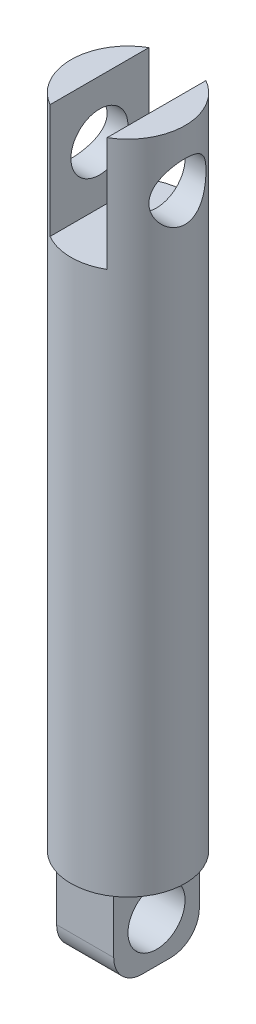
ISO-10303-21;
HEADER;
FILE_DESCRIPTION(('STEP AP214'),'2;1');
FILE_NAME('part.step','',(''),(''),'','','');
FILE_SCHEMA(('AUTOMOTIVE_DESIGN { 1 0 10303 214 1 1 1 1 }'));
ENDSEC;
DATA;
#1=APPLICATION_CONTEXT('core data for automotive mechanical design processes');
#2=APPLICATION_PROTOCOL_DEFINITION('international standard','automotive_design',2000,#1);
#3=PRODUCT_CONTEXT('',#1,'mechanical');
#4=PRODUCT('Part','Part','',(#3));
#5=PRODUCT_RELATED_PRODUCT_CATEGORY('part','',(#4));
#6=PRODUCT_DEFINITION_FORMATION('','',#4);
#7=PRODUCT_DEFINITION_CONTEXT('part definition',#1,'design');
#8=PRODUCT_DEFINITION('design','',#6,#7);
#9=PRODUCT_DEFINITION_SHAPE('','',#8);
#10=(LENGTH_UNIT() NAMED_UNIT(*) SI_UNIT(.MILLI.,.METRE.));
#11=(NAMED_UNIT(*) PLANE_ANGLE_UNIT() SI_UNIT($,.RADIAN.));
#12=(NAMED_UNIT(*) SI_UNIT($,.STERADIAN.) SOLID_ANGLE_UNIT());
#13=UNCERTAINTY_MEASURE_WITH_UNIT(LENGTH_MEASURE(1.E-05),#10,'distance_accuracy_value','');
#14=(GEOMETRIC_REPRESENTATION_CONTEXT(3) GLOBAL_UNCERTAINTY_ASSIGNED_CONTEXT((#13)) GLOBAL_UNIT_ASSIGNED_CONTEXT((#10,
#11,#12)) REPRESENTATION_CONTEXT('',''));
#15=CARTESIAN_POINT('',(0.,0.,0.));
#16=DIRECTION('',(0.,0.,1.));
#17=DIRECTION('',(1.,0.,0.));
#18=AXIS2_PLACEMENT_3D('',#15,#16,#17);
#19=CARTESIAN_POINT('',(0.,115.,0.));
#20=DIRECTION('',(0.,1.,0.));
#21=DIRECTION('',(0.,0.,1.));
#22=AXIS2_PLACEMENT_3D('',#19,#20,#21);
#23=PLANE('',#22);
#24=DIRECTION('',(0.,0.,-1.));
#25=VECTOR('',#24,1.);
#26=CARTESIAN_POINT('',(5.,115.,0.));
#27=LINE('',#26,#25);
#28=CARTESIAN_POINT('',(5.,115.,8.66025403784438));
#29=VERTEX_POINT('',#28);
#30=CARTESIAN_POINT('',(5.,115.,-8.66025403784439));
#31=VERTEX_POINT('',#30);
#32=EDGE_CURVE('E124',#29,#31,#27,.T.);
#33=ORIENTED_EDGE('',*,*,#32,.F.);
#34=CARTESIAN_POINT('',(0.,115.,0.));
#35=DIRECTION('',(0.,1.,0.));
#36=DIRECTION('',(0.,0.,1.));
#37=AXIS2_PLACEMENT_3D('',#34,#35,#36);
#38=CIRCLE('',#37,10.);
#39=EDGE_CURVE('E139',#29,#31,#38,.T.);
#40=ORIENTED_EDGE('',*,*,#39,.T.);
#41=EDGE_LOOP('',(#33,#40));
#42=FACE_BOUND('',#41,.T.);
#43=ADVANCED_FACE('F39',(#42),#23,.T.);
#44=CARTESIAN_POINT('',(0.,0.,0.));
#45=DIRECTION('',(0.,1.,0.));
#46=DIRECTION('',(0.,0.,1.));
#47=AXIS2_PLACEMENT_3D('',#44,#45,#46);
#48=PLANE('',#47);
#49=CARTESIAN_POINT('',(0.,0.,0.));
#50=DIRECTION('',(0.,1.,0.));
#51=DIRECTION('',(0.,0.,1.));
#52=AXIS2_PLACEMENT_3D('',#49,#50,#51);
#53=CIRCLE('',#52,10.);
#54=CARTESIAN_POINT('',(0.,0.,10.));
#55=VERTEX_POINT('',#54);
#56=EDGE_CURVE('E190',#55,#55,#53,.T.);
#57=ORIENTED_EDGE('',*,*,#56,.F.);
#58=EDGE_LOOP('',(#57));
#59=FACE_BOUND('',#58,.T.);
#60=DIRECTION('',(0.,0.,-1.));
#61=VECTOR('',#60,1.);
#62=CARTESIAN_POINT('',(-5.,0.,7.5));
#63=LINE('',#62,#61);
#64=CARTESIAN_POINT('',(-5.,0.,7.5));
#65=VERTEX_POINT('',#64);
#66=CARTESIAN_POINT('',(-5.,0.,-7.5));
#67=VERTEX_POINT('',#66);
#68=EDGE_CURVE('E164',#65,#67,#63,.T.);
#69=ORIENTED_EDGE('',*,*,#68,.F.);
#70=DIRECTION('',(-1.,0.,0.));
#71=VECTOR('',#70,1.);
#72=CARTESIAN_POINT('',(5.,0.,7.5));
#73=LINE('',#72,#71);
#74=CARTESIAN_POINT('',(5.,0.,7.5));
#75=VERTEX_POINT('',#74);
#76=EDGE_CURVE('E159',#75,#65,#73,.T.);
#77=ORIENTED_EDGE('',*,*,#76,.F.);
#78=DIRECTION('',(0.,0.,1.));
#79=VECTOR('',#78,1.);
#80=CARTESIAN_POINT('',(5.,0.,7.5));
#81=LINE('',#80,#79);
#82=CARTESIAN_POINT('',(5.,0.,-7.5));
#83=VERTEX_POINT('',#82);
#84=EDGE_CURVE('E172',#83,#75,#81,.T.);
#85=ORIENTED_EDGE('',*,*,#84,.F.);
#86=DIRECTION('',(1.,0.,0.));
#87=VECTOR('',#86,1.);
#88=CARTESIAN_POINT('',(5.,0.,-7.5));
#89=LINE('',#88,#87);
#90=EDGE_CURVE('E168',#67,#83,#89,.T.);
#91=ORIENTED_EDGE('',*,*,#90,.F.);
#92=EDGE_LOOP('',(#69,#77,#85,#91));
#93=FACE_BOUND('',#92,.T.);
#94=ADVANCED_FACE('F238',(#59,#93),#48,.F.);
#95=CARTESIAN_POINT('',(0.,95.,0.));
#96=DIRECTION('',(0.,-1.,0.));
#97=DIRECTION('',(0.,0.,-1.));
#98=AXIS2_PLACEMENT_3D('',#95,#96,#97);
#99=CYLINDRICAL_SURFACE('',#98,10.);
#100=CARTESIAN_POINT('',(-10.,100.,0.));
#101=CARTESIAN_POINT('',(-9.99999960171885,100.000000432216,-0.131488890078729));
#102=CARTESIAN_POINT('',(-9.99740053121284,100.005192775285,-0.262986970217153));
#103=CARTESIAN_POINT('',(-9.98706977835168,100.025902894112,-0.525014586348057));
#104=CARTESIAN_POINT('',(-9.97933586314931,100.041425161764,-0.655543676003295));
#105=CARTESIAN_POINT('',(-9.95892066969002,100.082640779477,-0.914783203431134));
#106=CARTESIAN_POINT('',(-9.94623233642882,100.108348634406,-1.04349077535257));
#107=CARTESIAN_POINT('',(-9.91622716576671,100.169650672563,-1.29802636754293));
#108=CARTESIAN_POINT('',(-9.89890843630383,100.205248897406,-1.42385318781692));
#109=CARTESIAN_POINT('',(-9.86015430154804,100.285778482451,-1.67121386584967));
#110=CARTESIAN_POINT('',(-9.83873709670758,100.330668648548,-1.79276399094561));
#111=CARTESIAN_POINT('',(-9.79224427489324,100.429448797807,-2.0314444775119));
#112=CARTESIAN_POINT('',(-9.7671672814684,100.483342168193,-2.14857315511665));
#113=CARTESIAN_POINT('',(-9.68730860488736,100.657799628939,-2.49222561412914));
#114=CARTESIAN_POINT('',(-9.6278546021617,100.79123077324,-2.71128846115304));
#115=CARTESIAN_POINT('',(-9.49780663424161,101.097605281245,-3.13758045755124));
#116=CARTESIAN_POINT('',(-9.42675632671347,101.27245069028,-3.34329192972867));
#117=CARTESIAN_POINT('',(-9.28300214475253,101.652589088283,-3.72388133818108));
#118=CARTESIAN_POINT('',(-9.21029705743542,101.857905061984,-3.89873577832563));
#119=CARTESIAN_POINT('',(-9.06493867332992,102.312475147464,-4.22628385620055));
#120=CARTESIAN_POINT('',(-8.99272664170301,102.563901891317,-4.37620734766694));
#121=CARTESIAN_POINT('',(-8.89637417546676,102.959918044368,-4.56723365243868));
#122=CARTESIAN_POINT('',(-8.86624279684719,103.09511829056,-4.62527981130998));
#123=CARTESIAN_POINT('',(-8.81109611627222,103.371001251774,-4.72948843578257));
#124=CARTESIAN_POINT('',(-8.78607778701962,103.511680663639,-4.77565793744269));
#125=CARTESIAN_POINT('',(-8.74350562362058,103.788992754156,-4.8531380584616));
#126=CARTESIAN_POINT('',(-8.72559704108876,103.925370479978,-4.88516762296959));
#127=CARTESIAN_POINT('',(-8.69596333711106,104.20092569748,-4.93772573892406));
#128=CARTESIAN_POINT('',(-8.68423493515241,104.340101663006,-4.95826039236648));
#129=CARTESIAN_POINT('',(-8.66746161087014,104.620007461111,-4.98752398958936));
#130=CARTESIAN_POINT('',(-8.66241266349287,104.760736306314,-4.99626004329765));
#131=CARTESIAN_POINT('',(-8.65921299638944,105.04250117629,-5.00180399494055));
#132=CARTESIAN_POINT('',(-8.66106161851229,105.183537170471,-4.99861303092504));
#133=CARTESIAN_POINT('',(-8.67093727173593,105.447703572877,-4.98145803092846));
#134=CARTESIAN_POINT('',(-8.6781966350113,105.57095260281,-4.96883208371091));
#135=CARTESIAN_POINT('',(-8.69773906996623,105.815821213967,-4.93454402662215));
#136=CARTESIAN_POINT('',(-8.71002371946268,105.937440271022,-4.91287907868334));
#137=CARTESIAN_POINT('',(-8.73921479576949,106.178197874313,-4.86076278292653));
#138=CARTESIAN_POINT('',(-8.75612065195561,106.29733672485,-4.83031251988904));
#139=CARTESIAN_POINT('',(-8.79403073984606,106.532471376954,-4.76094319159973));
#140=CARTESIAN_POINT('',(-8.81503658165343,106.648465923276,-4.72202079856857));
#141=CARTESIAN_POINT('',(-8.88436032421636,106.996006871619,-4.59108661358502));
#142=CARTESIAN_POINT('',(-8.93828791833521,107.221693356038,-4.48608785825887));
#143=CARTESIAN_POINT('',(-9.05517433078603,107.653210118223,-4.24519591002764));
#144=CARTESIAN_POINT('',(-9.11813720101033,107.859031417759,-4.10928884013355));
#145=CARTESIAN_POINT('',(-9.25565455759079,108.272588528204,-3.79034422310329));
#146=CARTESIAN_POINT('',(-9.3306665420313,108.477258007707,-3.60351571642877));
#147=CARTESIAN_POINT('',(-9.47739013910051,108.853703465689,-3.19773444843253));
#148=CARTESIAN_POINT('',(-9.54910016205801,109.025463723821,-2.97876642220598));
#149=CARTESIAN_POINT('',(-9.65034506582221,109.258440897113,-2.62430600098782));
#150=CARTESIAN_POINT('',(-9.68370380274255,109.333352095146,-2.4987100233616));
#151=CARTESIAN_POINT('',(-9.74663052718473,109.472208202972,-2.24071060142561));
#152=CARTESIAN_POINT('',(-9.77620011135783,109.536157735591,-2.1083100575541));
#153=CARTESIAN_POINT('',(-9.83067553510545,109.652398875383,-1.83762803314804));
#154=CARTESIAN_POINT('',(-9.85558325144946,109.704695175525,-1.6993489468218));
#155=CARTESIAN_POINT('',(-9.89999026457503,109.79702492908,-1.41791187896085));
#156=CARTESIAN_POINT('',(-9.91949018350378,109.837059793182,-1.27475446078988));
#157=CARTESIAN_POINT('',(-9.95109597328192,109.901533563503,-0.996798015430418));
#158=CARTESIAN_POINT('',(-9.96368046334326,109.926989515402,-0.862288674029802));
#159=CARTESIAN_POINT('',(-9.98343035732268,109.966808041224,-0.59124836001247));
#160=CARTESIAN_POINT('',(-9.99059624028198,109.98117159579,-0.454717567193955));
#161=CARTESIAN_POINT('',(-9.99930380487356,109.998613162034,-0.18081070935965));
#162=CARTESIAN_POINT('',(-10.000847639673,110.001695494267,-0.0434349881359027));
#163=CARTESIAN_POINT('',(-9.99827237859039,109.996544426081,0.231047608581548));
#164=CARTESIAN_POINT('',(-9.99415353332644,109.988311526451,0.368154495704337));
#165=CARTESIAN_POINT('',(-9.98090973082445,109.961721326159,0.630324023952242));
#166=CARTESIAN_POINT('',(-9.97219922243105,109.944201622407,0.755493751243215));
#167=CARTESIAN_POINT('',(-9.95027227352716,109.899825526429,1.00380426086804));
#168=CARTESIAN_POINT('',(-9.93705440583578,109.872966176907,1.12694438760007));
#169=CARTESIAN_POINT('',(-9.90642450404115,109.810197316637,1.37032307172125));
#170=CARTESIAN_POINT('',(-9.88901375346268,109.774290575322,1.49056250470175));
#171=CARTESIAN_POINT('',(-9.85039368148873,109.693771838677,1.72747946867538));
#172=CARTESIAN_POINT('',(-9.82918290524069,109.649156508647,1.84415561535681));
#173=CARTESIAN_POINT('',(-9.75922876416581,109.50005219315,2.19430354472275));
#174=CARTESIAN_POINT('',(-9.70504904478179,109.382059258215,2.42111320848944));
#175=CARTESIAN_POINT('',(-9.58719375745591,109.11444780678,2.8523456015808));
#176=CARTESIAN_POINT('',(-9.5235141477638,108.964815818008,3.05675873773467));
#177=CARTESIAN_POINT('',(-9.38541505392104,108.621212708963,3.45882132675025));
#178=CARTESIAN_POINT('',(-9.31055499361995,108.424330408248,3.65383533419945));
#179=CARTESIAN_POINT('',(-9.16310881759143,108.000329462866,4.00930667677967));
#180=CARTESIAN_POINT('',(-9.09052430437331,107.773190076002,4.16974010650665));
#181=CARTESIAN_POINT('',(-8.98785260582618,107.407509433771,4.38466016919211));
#182=CARTESIAN_POINT('',(-8.95395955241383,107.278149125457,4.4532676226712));
#183=CARTESIAN_POINT('',(-8.89022352415079,107.013105899221,4.57918112262684));
#184=CARTESIAN_POINT('',(-8.86037871680369,106.877425879624,4.63649228788887));
#185=CARTESIAN_POINT('',(-8.80590327365628,106.600722964675,4.73913999074899));
#186=CARTESIAN_POINT('',(-8.78126837994728,106.45970454425,4.78448631442401));
#187=CARTESIAN_POINT('',(-8.73822819098157,106.173308957175,4.86265004333096));
#188=CARTESIAN_POINT('',(-8.7198219312185,106.027932469172,4.89546938847112));
#189=CARTESIAN_POINT('',(-8.69151275671386,105.748235018465,4.94553834792943));
#190=CARTESIAN_POINT('',(-8.6809632703526,105.61419211688,4.96397997433445));
#191=CARTESIAN_POINT('',(-8.66606824539577,105.344714754303,4.98993873206133));
#192=CARTESIAN_POINT('',(-8.66172205679783,105.209280440605,4.99745700797003));
#193=CARTESIAN_POINT('',(-8.65941425656731,104.938243074995,5.00145477351749));
#194=CARTESIAN_POINT('',(-8.66145040076353,104.80264009915,4.99793814327599));
#195=CARTESIAN_POINT('',(-8.67181681785816,104.532414442052,4.97992974203947));
#196=CARTESIAN_POINT('',(-8.68014683308828,104.397791720895,4.96543842034337));
#197=CARTESIAN_POINT('',(-8.70167828744801,104.143439797841,4.92759757627216));
#198=CARTESIAN_POINT('',(-8.71433770908853,104.023517440376,4.90522766015001));
#199=CARTESIAN_POINT('',(-8.74411599480516,103.786138809433,4.85194376743194));
#200=CARTESIAN_POINT('',(-8.76123623781642,103.668683310666,4.82102714868723));
#201=CARTESIAN_POINT('',(-8.81854231868724,103.321082884887,4.7159030607396));
#202=CARTESIAN_POINT('',(-8.86468813771129,103.095543905014,4.62929708984156));
#203=CARTESIAN_POINT('',(-8.97142890954605,102.646839657687,4.41907164675021));
#204=CARTESIAN_POINT('',(-9.03278633647388,102.424851924011,4.29335633682032));
#205=CARTESIAN_POINT('',(-9.16176636495219,102.003635890404,4.01075421010746));
#206=CARTESIAN_POINT('',(-9.22939221620456,101.804419516556,3.85385117607733));
#207=CARTESIAN_POINT('',(-9.37311444600789,101.409292141529,3.49102748964407));
#208=CARTESIAN_POINT('',(-9.44924162905911,101.216723981232,3.281467363426));
#209=CARTESIAN_POINT('',(-9.59389514971534,100.868665578817,2.83072875767416));
#210=CARTESIAN_POINT('',(-9.66241737976036,100.713195322256,2.58953334336127));
#211=CARTESIAN_POINT('',(-9.7541901337583,100.511369585473,2.20753881885375));
#212=CARTESIAN_POINT('',(-9.78304209980293,100.449132920594,2.07625512570271));
#213=CARTESIAN_POINT('',(-9.83614745234555,100.33606384388,1.80799529933999));
#214=CARTESIAN_POINT('',(-9.8604030970797,100.285225829469,1.67102200205152));
#215=CARTESIAN_POINT('',(-9.90354484128718,100.195654561633,1.39269501068689));
#216=CARTESIAN_POINT('',(-9.92244264379385,100.156894907012,1.25135162347082));
#217=CARTESIAN_POINT('',(-9.95434618112011,100.091862403731,0.965237205795564));
#218=CARTESIAN_POINT('',(-9.96735551489675,100.065581927473,0.82046832604838));
#219=CARTESIAN_POINT('',(-9.98476387878718,100.030525468001,0.563041654408166));
#220=CARTESIAN_POINT('',(-9.99046741601666,100.019088246308,0.450825809730031));
#221=CARTESIAN_POINT('',(-9.99808569986015,100.00382522175,0.22574224605027));
#222=CARTESIAN_POINT('',(-10.000000341898,99.9999996289711,0.11287450914219));
#223=CARTESIAN_POINT('',(-10.,100.,0.));
#224=B_SPLINE_CURVE_WITH_KNOTS('',3,(#100,#101,#102,#103,#104,#105,#106,#107,#108,#109,#110,
#111,#112,#113,#114,#115,#116,#117,#118,#119,#120,#121,#122,#123,#124,#125,#126,#127,#128,#129,
#130,#131,#132,#133,#134,#135,#136,#137,#138,#139,#140,#141,#142,#143,#144,#145,#146,#147,#148,
#149,#150,#151,#152,#153,#154,#155,#156,#157,#158,#159,#160,#161,#162,#163,#164,#165,#166,#167,
#168,#169,#170,#171,#172,#173,#174,#175,#176,#177,#178,#179,#180,#181,#182,#183,#184,#185,#186,
#187,#188,#189,#190,#191,#192,#193,#194,#195,#196,#197,#198,#199,#200,#201,#202,#203,#204,#205,
#206,#207,#208,#209,#210,#211,#212,#213,#214,#215,#216,#217,#218,#219,#220,#221,#222,#223),
.UNSPECIFIED.,.T.,.F.,(4,2,2,2,2,2,2,2,2,2,2,2,2,2,2,2,2,2,2,2,2,2,2,2,2,2,2,2,2,2,2,2,2,2,2,2,
2,2,2,2,2,2,2,2,2,2,2,2,2,2,2,2,2,2,2,2,2,2,2,2,2,4),(0.,0.394355294649891,0.788882184037819,
1.18397293369035,1.57922537181693,1.97276168530542,2.36644639154632,3.15295441699267,
3.98704440767527,4.821766802355,5.72122193562247,6.1712535998946,6.62101803579305,
7.04410338623952,7.46696393118357,7.88956954321094,8.31213483216671,8.68401534897463,
9.05601271689173,9.42796417149689,9.80006198990963,10.5608338020501,11.3219478566368,
12.1795688603196,13.03759852356,13.4870830845772,13.9363776171859,14.3854908824168,
14.8345524573652,15.2464230691107,15.6582572644723,16.0699337163998,16.4815919489941,
16.8612200640511,17.240968493866,17.6206008225791,18.0003788066131,18.7808755264615,
19.5617052624835,20.4192132572739,21.2773121558255,21.7277011924366,22.1778856687596,
22.6277007885002,23.0774462222894,23.4840267197959,23.8905646113036,24.2969595710184,
24.703337894006,25.0708552370355,25.4384863225851,26.1732662495599,26.9574126491567,
27.7419678673239,28.6218519479817,29.5022089791542,29.9460734671028,30.3897193096444,
30.8323885049027,31.2747867798493,31.6133053554877,31.9518332743452),.UNSPECIFIED.);
#225=CARTESIAN_POINT('',(-10.,100.,0.));
#226=VERTEX_POINT('',#225);
#227=EDGE_CURVE('E233',#226,#226,#224,.T.);
#228=ORIENTED_EDGE('',*,*,#227,.T.);
#229=EDGE_LOOP('',(#228));
#230=FACE_BOUND('',#229,.T.);
#231=CARTESIAN_POINT('',(8.66025403784438,105.,-5.00000000000001));
#232=CARTESIAN_POINT('',(8.66025482828518,104.869668343204,-4.99999937774204));
#233=CARTESIAN_POINT('',(8.66320639320551,104.739325091653,-4.99489703999515));
#234=CARTESIAN_POINT('',(8.67490215579888,104.479644781747,-4.97455590140419));
#235=CARTESIAN_POINT('',(8.68364905023327,104.3503082202,-4.95931238151412));
#236=CARTESIAN_POINT('',(8.7066291238278,104.093486462436,-4.91885673177677));
#237=CARTESIAN_POINT('',(8.72087090589727,103.966004496215,-4.89362896878987));
#238=CARTESIAN_POINT('',(8.75432466229381,103.713982535512,-4.83352579766963));
#239=CARTESIAN_POINT('',(8.77353879767271,103.589443845965,-4.79864619425837));
#240=CARTESIAN_POINT('',(8.83745677232208,103.222888792466,-4.6805346614708));
#241=CARTESIAN_POINT('',(8.88859880977519,102.986267679266,-4.58356144574886));
#242=CARTESIAN_POINT('',(9.00213659941723,102.532838045211,-4.35632594214356));
#243=CARTESIAN_POINT('',(9.06453296036385,102.316030597053,-4.22606185336435));
#244=CARTESIAN_POINT('',(9.19984032823,101.888489382253,-3.92334549410417));
#245=CARTESIAN_POINT('',(9.27319410334729,101.679731417677,-3.74829976483492));
#246=CARTESIAN_POINT('',(9.41860822234892,101.292930948451,-3.36622943427774));
#247=CARTESIAN_POINT('',(9.49066790509843,101.114903765034,-3.15918897852743));
#248=CARTESIAN_POINT('',(9.59484443095073,100.868773571314,-2.82033206345806));
#249=CARTESIAN_POINT('',(9.62993554487431,100.788086847899,-2.69838192133584));
#250=CARTESIAN_POINT('',(9.69680156689125,100.637371334578,-2.44722131237051));
#251=CARTESIAN_POINT('',(9.72857779329811,100.567338302637,-2.31801376345374));
#252=CARTESIAN_POINT('',(9.78789520431625,100.438623768707,-2.05317391777882));
#253=CARTESIAN_POINT('',(9.81543747951443,100.37993934252,-1.91754328730047));
#254=CARTESIAN_POINT('',(9.86547242365067,100.274568984172,-1.64079696990286));
#255=CARTESIAN_POINT('',(9.88796562891049,100.227881777567,-1.49968186742444));
#256=CARTESIAN_POINT('',(9.92580359946711,100.149984487482,-1.22330436599559));
#257=CARTESIAN_POINT('',(9.94154295735176,100.117909890396,-1.08833937324155));
#258=CARTESIAN_POINT('',(9.96761571585522,100.065033571396,-0.815709188800207));
#259=CARTESIAN_POINT('',(9.97794964280152,100.04423075194,-0.678044261360653));
#260=CARTESIAN_POINT('',(9.99290900237256,100.014180088583,-0.401217055741354));
#261=CARTESIAN_POINT('',(9.99753719051025,100.004926667024,-0.262055533104006));
#262=CARTESIAN_POINT('',(10.0009568128334,99.9980856666018,0.0166220416280755));
#263=CARTESIAN_POINT('',(9.99974860411976,100.000497374006,0.156138071510189));
#264=CARTESIAN_POINT('',(9.99189263105534,100.016230602951,0.422158287145522));
#265=CARTESIAN_POINT('',(9.9857287219252,100.028581770782,0.548735568605442));
#266=CARTESIAN_POINT('',(9.9687211507105,100.062832572355,0.800312348574876));
#267=CARTESIAN_POINT('',(9.95787601100424,100.084735221026,0.925311336065695));
#268=CARTESIAN_POINT('',(9.93176736436012,100.137846224237,1.17280363036129));
#269=CARTESIAN_POINT('',(9.91650533549045,100.169051465862,1.29529776073404));
#270=CARTESIAN_POINT('',(9.88192155120269,100.240447651518,1.53706747687735));
#271=CARTESIAN_POINT('',(9.86259824100145,100.280642037248,1.65634181022021));
#272=CARTESIAN_POINT('',(9.79859222392452,100.415374539564,2.01140340124729));
#273=CARTESIAN_POINT('',(9.74822622058319,100.523368958893,2.24122720645224));
#274=CARTESIAN_POINT('',(9.63687815372568,100.771329692493,2.67992393299637));
#275=CARTESIAN_POINT('',(9.57589229137331,100.911307453156,2.88878931500039));
#276=CARTESIAN_POINT('',(9.44222356886893,101.234463473773,3.30085071454948));
#277=CARTESIAN_POINT('',(9.36897995679247,101.420474603121,3.50164452019891));
#278=CARTESIAN_POINT('',(9.22270586177088,101.822989193921,3.87054772569917));
#279=CARTESIAN_POINT('',(9.14967558498933,102.039515896908,4.03863197852249));
#280=CARTESIAN_POINT('',(9.04390911775424,102.391193537281,4.26795395788391));
#281=CARTESIAN_POINT('',(9.00829977481543,102.51705093115,4.34240098162072));
#282=CARTESIAN_POINT('',(8.94051483957135,102.77551387827,4.48030007564995));
#283=CARTESIAN_POINT('',(8.90833780331999,102.908116558879,4.54375677655289));
#284=CARTESIAN_POINT('',(8.84860631442917,103.179203490355,4.65901104656178));
#285=CARTESIAN_POINT('',(8.82104906525582,103.317684118981,4.71081567564999));
#286=CARTESIAN_POINT('',(8.7716484423619,103.599621346051,4.80217514780264));
#287=CARTESIAN_POINT('',(8.74980428958556,103.743077263025,4.84173166119403));
#288=CARTESIAN_POINT('',(8.71426171459813,104.022256935075,4.90539138118898));
#289=CARTESIAN_POINT('',(8.7000553284825,104.157693733558,4.93047005719825));
#290=CARTESIAN_POINT('',(8.67788216659553,104.430671907805,4.96939299432913));
#291=CARTESIAN_POINT('',(8.6699146257062,104.568213023391,4.98323863305272));
#292=CARTESIAN_POINT('',(8.66056020235632,104.844115492459,4.99947854378906));
#293=CARTESIAN_POINT('',(8.65916956150024,104.98247633223,5.00187935599941));
#294=CARTESIAN_POINT('',(8.66301922537735,105.258820904933,4.99520900229025));
#295=CARTESIAN_POINT('',(8.66825908252539,105.396804662689,4.98613861072294));
#296=CARTESIAN_POINT('',(8.68421505193302,105.656088079399,4.9582892803938));
#297=CARTESIAN_POINT('',(8.69426699139328,105.777556714335,4.94068517767345));
#298=CARTESIAN_POINT('',(8.71910498639122,106.018417575916,4.89671673345792));
#299=CARTESIAN_POINT('',(8.7338925000332,106.137809151073,4.87034969372093));
#300=CARTESIAN_POINT('',(8.7846960742619,106.491710041443,4.7785029798087));
#301=CARTESIAN_POINT('',(8.82716454630259,106.722114291832,4.70025914597571));
#302=CARTESIAN_POINT('',(8.92681241600885,107.177093235683,4.50823244687957));
#303=CARTESIAN_POINT('',(8.98458205429472,107.400903691952,4.39297142446301));
#304=CARTESIAN_POINT('',(9.10780608277643,107.82733774558,4.1314342135104));
#305=CARTESIAN_POINT('',(9.1732644129012,108.029950379078,3.9851420924436));
#306=CARTESIAN_POINT('',(9.31439795768909,108.434891403638,3.64419701683803));
#307=CARTESIAN_POINT('',(9.39032093861059,108.63396448388,3.44577250062108));
#308=CARTESIAN_POINT('',(9.53671997076951,108.997082466847,3.01697632238968));
#309=CARTESIAN_POINT('',(9.60719417697592,109.161115537395,2.78659391213233));
#310=CARTESIAN_POINT('',(9.70419418614479,109.379009473771,2.41774074756936));
#311=CARTESIAN_POINT('',(9.73542921288423,109.44766209982,2.28903769990885));
#312=CARTESIAN_POINT('',(9.79367711332059,109.573756518654,2.02535752273872));
#313=CARTESIAN_POINT('',(9.82069185600805,109.631203276876,1.89038320507348));
#314=CARTESIAN_POINT('',(9.86968940022035,109.734217908457,1.61516754079525));
#315=CARTESIAN_POINT('',(9.89167460130352,109.779791447889,1.47492874316052));
#316=CARTESIAN_POINT('',(9.92995088678441,109.858509076018,1.19024723850078));
#317=CARTESIAN_POINT('',(9.94624264638291,109.891654638615,1.04580503217189));
#318=CARTESIAN_POINT('',(9.97139931839171,109.942595033624,0.767401441682128));
#319=CARTESIAN_POINT('',(9.98080865626407,109.961519602643,0.633694933854983));
#320=CARTESIAN_POINT('',(9.99424478074505,109.988493453182,0.364924207537128));
#321=CARTESIAN_POINT('',(9.9982719832244,109.996543574957,0.229860094759435));
#322=CARTESIAN_POINT('',(10.0008314531461,110.001663177181,-0.0404881253987306));
#323=CARTESIAN_POINT('',(9.999365319798,109.998735853363,-0.175772157294897));
#324=CARTESIAN_POINT('',(9.99098333266103,109.981947452247,-0.445485239489128));
#325=CARTESIAN_POINT('',(9.98406762889855,109.968086675948,-0.579914313221439));
#326=CARTESIAN_POINT('',(9.96560870935097,109.930882320583,-0.838004211928035));
#327=CARTESIAN_POINT('',(9.95440210269674,109.908227165773,-0.961788818118182));
#328=CARTESIAN_POINT('',(9.92767317989821,109.853786844462,-1.20687032491423));
#329=CARTESIAN_POINT('',(9.91214948953036,109.821998770643,-1.32816642014826));
#330=CARTESIAN_POINT('',(9.859612953764,109.713391755729,-1.68709586409475));
#331=CARTESIAN_POINT('',(9.81661817605329,109.623298074914,-1.91998814282437));
#332=CARTESIAN_POINT('',(9.71629432734439,109.40635777828,-2.37715486497025));
#333=CARTESIAN_POINT('',(9.65843082383811,109.278104034551,-2.60063468941493));
#334=CARTESIAN_POINT('',(9.53440669320975,108.990209694815,-3.02386422902506));
#335=CARTESIAN_POINT('',(9.46824226032902,108.830554682968,-3.22360297720279));
#336=CARTESIAN_POINT('',(9.32643278468726,108.466024828893,-3.61456788757425));
#337=CARTESIAN_POINT('',(9.25049954016331,108.258230966454,-3.80296860888285));
#338=CARTESIAN_POINT('',(9.1031442101187,107.812702952285,-4.14333626823684));
#339=CARTESIAN_POINT('',(9.03172615645363,107.574942593432,-4.29527097306548));
#340=CARTESIAN_POINT('',(8.93341291054547,107.195780333282,-4.49442606762735));
#341=CARTESIAN_POINT('',(8.90168698468313,107.063373671791,-4.55675683233958));
#342=CARTESIAN_POINT('',(8.8428797220414,106.792744536233,-4.66985426801939));
#343=CARTESIAN_POINT('',(8.81579599491154,106.654525101206,-4.72062689492349));
#344=CARTESIAN_POINT('',(8.76742025858706,106.373592125707,-4.80987708806144));
#345=CARTESIAN_POINT('',(8.74611337114852,106.230891206915,-4.8483862843261));
#346=CARTESIAN_POINT('',(8.71014784774038,105.941907855529,-4.91270711070744));
#347=CARTESIAN_POINT('',(8.69548456411172,105.795628002391,-4.93852761851022));
#348=CARTESIAN_POINT('',(8.67647541111358,105.541002113071,-4.97182308032503));
#349=CARTESIAN_POINT('',(8.67040719452513,105.433175783773,-4.98237929832923));
#350=CARTESIAN_POINT('',(8.66229604436744,105.216902340018,-4.9964682519998));
#351=CARTESIAN_POINT('',(8.66025338008092,105.108455184517,-5.00000051781052));
#352=CARTESIAN_POINT('',(8.66025403784438,105.,-5.00000000000001));
#353=B_SPLINE_CURVE_WITH_KNOTS('',3,(#231,#232,#233,#234,#235,#236,#237,#238,#239,#240,#241,
#242,#243,#244,#245,#246,#247,#248,#249,#250,#251,#252,#253,#254,#255,#256,#257,#258,#259,#260,
#261,#262,#263,#264,#265,#266,#267,#268,#269,#270,#271,#272,#273,#274,#275,#276,#277,#278,#279,
#280,#281,#282,#283,#284,#285,#286,#287,#288,#289,#290,#291,#292,#293,#294,#295,#296,#297,#298,
#299,#300,#301,#302,#303,#304,#305,#306,#307,#308,#309,#310,#311,#312,#313,#314,#315,#316,#317,
#318,#319,#320,#321,#322,#323,#324,#325,#326,#327,#328,#329,#330,#331,#332,#333,#334,#335,#336,
#337,#338,#339,#340,#341,#342,#343,#344,#345,#346,#347,#348,#349,#350,#351,#352),.UNSPECIFIED.,
.T.,.F.,(4,2,2,2,2,2,2,2,2,2,2,2,2,2,2,2,2,2,2,2,2,2,2,2,2,2,2,2,2,2,2,2,2,2,2,2,2,2,2,2,2,2,2,
2,2,2,2,2,2,2,2,2,2,2,2,2,2,2,2,2,4),(0.,0.390882384556478,0.781946787673771,1.17362595011564,
1.56547562833136,2.34415414386117,3.12287479153475,3.96582272680017,4.80918971852757,
5.25982992442628,5.71029022430253,6.16063429887938,6.61093051439737,7.02920538093653,
7.44743951241416,7.86547158389041,8.28347807833439,8.66500933177615,9.04666110301432,
9.42818530565611,9.80985583438834,10.5829669450729,11.3563551760292,12.2028497813491,
13.0499926207969,13.501002097322,13.9518210829089,14.4023661773263,14.8528498019289,
15.2676702585959,15.6824398346428,16.0969723603126,16.5114769048702,16.8804871114428,
17.2496110473149,17.9873544979167,18.759266696418,19.531576187116,20.4012390551443,
21.2711951250237,21.7182117808489,22.1650299066984,22.6116344121698,23.0581859356053,
23.4637505264203,23.8692837779652,24.2746989806128,24.6801030225936,25.0586722294314,
25.4373620814588,26.1940875134848,26.9831783738578,27.7726323429201,28.6406529303875,
29.5094379801419,29.9581473751206,30.4066250230037,30.8539364017616,31.3009343703532,
31.626184479533,31.9514563450476),.UNSPECIFIED.);
#354=CARTESIAN_POINT('',(8.66025403784438,105.,-5.00000000000001));
#355=VERTEX_POINT('',#354);
#356=EDGE_CURVE('E304',#355,#355,#353,.T.);
#357=ORIENTED_EDGE('',*,*,#356,.T.);
#358=EDGE_LOOP('',(#357));
#359=FACE_BOUND('',#358,.T.);
#360=CARTESIAN_POINT('',(0.,95.,0.));
#361=DIRECTION('',(0.,1.,0.));
#362=DIRECTION('',(0.,0.,1.));
#363=AXIS2_PLACEMENT_3D('',#360,#361,#362);
#364=CIRCLE('',#363,10.);
#365=CARTESIAN_POINT('',(5.,95.,-8.66025403784439));
#366=VERTEX_POINT('',#365);
#367=CARTESIAN_POINT('',(-5.,95.,-8.66025403784439));
#368=VERTEX_POINT('',#367);
#369=EDGE_CURVE('E11',#366,#368,#364,.T.);
#370=ORIENTED_EDGE('',*,*,#369,.F.);
#371=DIRECTION('',(0.,-1.,0.));
#372=VECTOR('',#371,1.);
#373=CARTESIAN_POINT('',(5.,95.,-8.66025403784439));
#374=LINE('',#373,#372);
#375=EDGE_CURVE('E146',#366,#31,#374,.F.);
#376=ORIENTED_EDGE('',*,*,#375,.T.);
#377=ORIENTED_EDGE('',*,*,#39,.F.);
#378=DIRECTION('',(0.,-1.,0.));
#379=VECTOR('',#378,1.);
#380=CARTESIAN_POINT('',(5.,95.,8.66025403784439));
#381=LINE('',#380,#379);
#382=CARTESIAN_POINT('',(5.,95.,8.66025403784439));
#383=VERTEX_POINT('',#382);
#384=EDGE_CURVE('E140',#29,#383,#381,.T.);
#385=ORIENTED_EDGE('',*,*,#384,.T.);
#386=CARTESIAN_POINT('',(-5.,95.,8.66025403784439));
#387=VERTEX_POINT('',#386);
#388=EDGE_CURVE('E49',#387,#383,#364,.T.);
#389=ORIENTED_EDGE('',*,*,#388,.F.);
#390=DIRECTION('',(0.,-1.,0.));
#391=VECTOR('',#390,1.);
#392=CARTESIAN_POINT('',(-5.,95.,8.66025403784439));
#393=LINE('',#392,#391);
#394=CARTESIAN_POINT('',(-5.,115.,8.66025403784439));
#395=VERTEX_POINT('',#394);
#396=EDGE_CURVE('E118',#387,#395,#393,.F.);
#397=ORIENTED_EDGE('',*,*,#396,.T.);
#398=CARTESIAN_POINT('',(-5.,115.,-8.66025403784439));
#399=VERTEX_POINT('',#398);
#400=EDGE_CURVE('E132',#399,#395,#38,.T.);
#401=ORIENTED_EDGE('',*,*,#400,.F.);
#402=DIRECTION('',(0.,-1.,0.));
#403=VECTOR('',#402,1.);
#404=CARTESIAN_POINT('',(-5.,95.,-8.66025403784439));
#405=LINE('',#404,#403);
#406=EDGE_CURVE('E56',#399,#368,#405,.T.);
#407=ORIENTED_EDGE('',*,*,#406,.T.);
#408=EDGE_LOOP('',(#370,#376,#377,#385,#389,#397,#401,#407));
#409=FACE_BOUND('',#408,.T.);
#410=ORIENTED_EDGE('',*,*,#56,.T.);
#411=EDGE_LOOP('',(#410));
#412=FACE_BOUND('',#411,.T.);
#413=ADVANCED_FACE('F130',(#230,#359,#409,#412),#99,.T.);
#414=CARTESIAN_POINT('',(-5.,-15.,7.5));
#415=DIRECTION('',(1.,0.,0.));
#416=DIRECTION('',(0.,0.,-1.));
#417=AXIS2_PLACEMENT_3D('',#414,#415,#416);
#418=PLANE('',#417);
#419=CARTESIAN_POINT('',(-5.,-7.5,0.));
#420=DIRECTION('',(-1.,0.,0.));
#421=DIRECTION('',(0.,0.,1.));
#422=AXIS2_PLACEMENT_3D('',#419,#420,#421);
#423=CIRCLE('',#422,5.);
#424=CARTESIAN_POINT('',(-5.,-7.5,5.));
#425=VERTEX_POINT('',#424);
#426=EDGE_CURVE('E145',#425,#425,#423,.T.);
#427=ORIENTED_EDGE('',*,*,#426,.F.);
#428=EDGE_LOOP('',(#427));
#429=FACE_BOUND('',#428,.T.);
#430=DIRECTION('',(0.,1.,0.));
#431=VECTOR('',#430,1.);
#432=CARTESIAN_POINT('',(-5.,-15.,-7.5));
#433=LINE('',#432,#431);
#434=CARTESIAN_POINT('',(-5.,-10.,-7.5));
#435=VERTEX_POINT('',#434);
#436=EDGE_CURVE('E187',#435,#67,#433,.T.);
#437=ORIENTED_EDGE('',*,*,#436,.F.);
#438=CARTESIAN_POINT('',(-5.,-10.,-2.5));
#439=DIRECTION('',(1.,0.,0.));
#440=DIRECTION('',(0.,0.,-1.));
#441=AXIS2_PLACEMENT_3D('',#438,#439,#440);
#442=CIRCLE('',#441,5.);
#443=CARTESIAN_POINT('',(-5.,-15.,-2.5));
#444=VERTEX_POINT('',#443);
#445=EDGE_CURVE('E216',#435,#444,#442,.F.);
#446=ORIENTED_EDGE('',*,*,#445,.T.);
#447=DIRECTION('',(0.,0.,-1.));
#448=VECTOR('',#447,1.);
#449=CARTESIAN_POINT('',(-5.,-15.,7.5));
#450=LINE('',#449,#448);
#451=CARTESIAN_POINT('',(-5.,-15.,2.5));
#452=VERTEX_POINT('',#451);
#453=EDGE_CURVE('E154',#452,#444,#450,.T.);
#454=ORIENTED_EDGE('',*,*,#453,.F.);
#455=CARTESIAN_POINT('',(-5.,-10.,2.5));
#456=DIRECTION('',(1.,0.,0.));
#457=DIRECTION('',(0.,0.,-1.));
#458=AXIS2_PLACEMENT_3D('',#455,#456,#457);
#459=CIRCLE('',#458,5.);
#460=CARTESIAN_POINT('',(-5.,-10.,7.5));
#461=VERTEX_POINT('',#460);
#462=EDGE_CURVE('E64',#452,#461,#459,.F.);
#463=ORIENTED_EDGE('',*,*,#462,.T.);
#464=DIRECTION('',(0.,1.,0.));
#465=VECTOR('',#464,1.);
#466=CARTESIAN_POINT('',(-5.,-15.,7.5));
#467=LINE('',#466,#465);
#468=EDGE_CURVE('E163',#461,#65,#467,.T.);
#469=ORIENTED_EDGE('',*,*,#468,.T.);
#470=ORIENTED_EDGE('',*,*,#68,.T.);
#471=EDGE_LOOP('',(#437,#446,#454,#463,#469,#470));
#472=FACE_BOUND('',#471,.T.);
#473=ADVANCED_FACE('F281',(#429,#472),#418,.F.);
#474=CARTESIAN_POINT('',(5.,-15.,-7.5));
#475=DIRECTION('',(0.,0.,1.));
#476=DIRECTION('',(1.,0.,0.));
#477=AXIS2_PLACEMENT_3D('',#474,#475,#476);
#478=PLANE('',#477);
#479=DIRECTION('',(0.,1.,0.));
#480=VECTOR('',#479,1.);
#481=CARTESIAN_POINT('',(5.,-15.,-7.5));
#482=LINE('',#481,#480);
#483=CARTESIAN_POINT('',(5.,-10.,-7.5));
#484=VERTEX_POINT('',#483);
#485=EDGE_CURVE('E184',#484,#83,#482,.T.);
#486=ORIENTED_EDGE('',*,*,#485,.F.);
#487=DIRECTION('',(1.,0.,0.));
#488=VECTOR('',#487,1.);
#489=CARTESIAN_POINT('',(5.,-10.,-7.5));
#490=LINE('',#489,#488);
#491=EDGE_CURVE('E211',#484,#435,#490,.F.);
#492=ORIENTED_EDGE('',*,*,#491,.T.);
#493=ORIENTED_EDGE('',*,*,#436,.T.);
#494=ORIENTED_EDGE('',*,*,#90,.T.);
#495=EDGE_LOOP('',(#486,#492,#493,#494));
#496=FACE_BOUND('',#495,.T.);
#497=ADVANCED_FACE('F275',(#496),#478,.F.);
#498=CARTESIAN_POINT('',(5.,-15.,7.5));
#499=DIRECTION('',(-1.,0.,0.));
#500=DIRECTION('',(0.,0.,1.));
#501=AXIS2_PLACEMENT_3D('',#498,#499,#500);
#502=PLANE('',#501);
#503=CARTESIAN_POINT('',(5.,-7.5,0.));
#504=DIRECTION('',(-1.,0.,0.));
#505=DIRECTION('',(0.,0.,1.));
#506=AXIS2_PLACEMENT_3D('',#503,#504,#505);
#507=CIRCLE('',#506,5.);
#508=CARTESIAN_POINT('',(5.,-7.5,5.));
#509=VERTEX_POINT('',#508);
#510=EDGE_CURVE('E153',#509,#509,#507,.T.);
#511=ORIENTED_EDGE('',*,*,#510,.T.);
#512=EDGE_LOOP('',(#511));
#513=FACE_BOUND('',#512,.T.);
#514=DIRECTION('',(0.,0.,1.));
#515=VECTOR('',#514,1.);
#516=CARTESIAN_POINT('',(5.,-15.,7.5));
#517=LINE('',#516,#515);
#518=CARTESIAN_POINT('',(5.,-15.,-2.5));
#519=VERTEX_POINT('',#518);
#520=CARTESIAN_POINT('',(5.,-15.,2.5));
#521=VERTEX_POINT('',#520);
#522=EDGE_CURVE('E158',#519,#521,#517,.T.);
#523=ORIENTED_EDGE('',*,*,#522,.F.);
#524=CARTESIAN_POINT('',(5.,-10.,-2.5));
#525=DIRECTION('',(-1.,0.,0.));
#526=DIRECTION('',(0.,0.,1.));
#527=AXIS2_PLACEMENT_3D('',#524,#525,#526);
#528=CIRCLE('',#527,5.);
#529=EDGE_CURVE('E208',#519,#484,#528,.F.);
#530=ORIENTED_EDGE('',*,*,#529,.T.);
#531=ORIENTED_EDGE('',*,*,#485,.T.);
#532=ORIENTED_EDGE('',*,*,#84,.T.);
#533=DIRECTION('',(0.,1.,0.));
#534=VECTOR('',#533,1.);
#535=CARTESIAN_POINT('',(5.,-15.,7.5));
#536=LINE('',#535,#534);
#537=CARTESIAN_POINT('',(5.,-10.,7.5));
#538=VERTEX_POINT('',#537);
#539=EDGE_CURVE('E181',#538,#75,#536,.T.);
#540=ORIENTED_EDGE('',*,*,#539,.F.);
#541=CARTESIAN_POINT('',(5.,-10.,2.5));
#542=DIRECTION('',(-1.,0.,0.));
#543=DIRECTION('',(0.,0.,1.));
#544=AXIS2_PLACEMENT_3D('',#541,#542,#543);
#545=CIRCLE('',#544,5.);
#546=EDGE_CURVE('E205',#538,#521,#545,.F.);
#547=ORIENTED_EDGE('',*,*,#546,.T.);
#548=EDGE_LOOP('',(#523,#530,#531,#532,#540,#547));
#549=FACE_BOUND('',#548,.T.);
#550=ADVANCED_FACE('F266',(#513,#549),#502,.F.);
#551=CARTESIAN_POINT('',(5.,-15.,7.5));
#552=DIRECTION('',(0.,0.,-1.));
#553=DIRECTION('',(-1.,0.,0.));
#554=AXIS2_PLACEMENT_3D('',#551,#552,#553);
#555=PLANE('',#554);
#556=ORIENTED_EDGE('',*,*,#468,.F.);
#557=DIRECTION('',(-1.,0.,0.));
#558=VECTOR('',#557,1.);
#559=CARTESIAN_POINT('',(5.,-10.,7.5));
#560=LINE('',#559,#558);
#561=EDGE_CURVE('E125',#461,#538,#560,.F.);
#562=ORIENTED_EDGE('',*,*,#561,.T.);
#563=ORIENTED_EDGE('',*,*,#539,.T.);
#564=ORIENTED_EDGE('',*,*,#76,.T.);
#565=EDGE_LOOP('',(#556,#562,#563,#564));
#566=FACE_BOUND('',#565,.T.);
#567=ADVANCED_FACE('F283',(#566),#555,.F.);
#568=CARTESIAN_POINT('',(0.,-15.,0.));
#569=DIRECTION('',(0.,1.,0.));
#570=DIRECTION('',(0.,0.,1.));
#571=AXIS2_PLACEMENT_3D('',#568,#569,#570);
#572=PLANE('',#571);
#573=ORIENTED_EDGE('',*,*,#453,.T.);
#574=DIRECTION('',(1.,0.,0.));
#575=VECTOR('',#574,1.);
#576=CARTESIAN_POINT('',(0.,-15.,-2.5));
#577=LINE('',#576,#575);
#578=EDGE_CURVE('E201',#444,#519,#577,.T.);
#579=ORIENTED_EDGE('',*,*,#578,.T.);
#580=ORIENTED_EDGE('',*,*,#522,.T.);
#581=DIRECTION('',(-1.,0.,0.));
#582=VECTOR('',#581,1.);
#583=CARTESIAN_POINT('',(0.,-15.,2.5));
#584=LINE('',#583,#582);
#585=EDGE_CURVE('E194',#521,#452,#584,.T.);
#586=ORIENTED_EDGE('',*,*,#585,.T.);
#587=EDGE_LOOP('',(#573,#579,#580,#586));
#588=FACE_BOUND('',#587,.T.);
#589=ADVANCED_FACE('F268',(#588),#572,.F.);
#590=CARTESIAN_POINT('',(10.,-7.5,0.));
#591=DIRECTION('',(-1.,0.,0.));
#592=DIRECTION('',(0.,0.,1.));
#593=AXIS2_PLACEMENT_3D('',#590,#591,#592);
#594=CYLINDRICAL_SURFACE('',#593,5.);
#595=ORIENTED_EDGE('',*,*,#426,.T.);
#596=EDGE_LOOP('',(#595));
#597=FACE_BOUND('',#596,.T.);
#598=ORIENTED_EDGE('',*,*,#510,.F.);
#599=EDGE_LOOP('',(#598));
#600=FACE_BOUND('',#599,.T.);
#601=ADVANCED_FACE('F258',(#597,#600),#594,.F.);
#602=CARTESIAN_POINT('',(0.,-10.,-2.5));
#603=DIRECTION('',(1.,0.,0.));
#604=DIRECTION('',(0.,0.,-1.));
#605=AXIS2_PLACEMENT_3D('',#602,#603,#604);
#606=CYLINDRICAL_SURFACE('',#605,5.);
#607=ORIENTED_EDGE('',*,*,#445,.F.);
#608=ORIENTED_EDGE('',*,*,#491,.F.);
#609=ORIENTED_EDGE('',*,*,#529,.F.);
#610=ORIENTED_EDGE('',*,*,#578,.F.);
#611=EDGE_LOOP('',(#607,#608,#609,#610));
#612=FACE_BOUND('',#611,.T.);
#613=ADVANCED_FACE('F253',(#612),#606,.T.);
#614=CARTESIAN_POINT('',(0.,-10.,2.5));
#615=DIRECTION('',(-1.,0.,0.));
#616=DIRECTION('',(0.,0.,1.));
#617=AXIS2_PLACEMENT_3D('',#614,#615,#616);
#618=CYLINDRICAL_SURFACE('',#617,5.);
#619=ORIENTED_EDGE('',*,*,#546,.F.);
#620=ORIENTED_EDGE('',*,*,#561,.F.);
#621=ORIENTED_EDGE('',*,*,#462,.F.);
#622=ORIENTED_EDGE('',*,*,#585,.F.);
#623=EDGE_LOOP('',(#619,#620,#621,#622));
#624=FACE_BOUND('',#623,.T.);
#625=ADVANCED_FACE('F41',(#624),#618,.T.);
#626=DIRECTION('',(0.,0.,1.));
#627=VECTOR('',#626,1.);
#628=CARTESIAN_POINT('',(-5.,115.,0.));
#629=LINE('',#628,#627);
#630=EDGE_CURVE('E115',#399,#395,#629,.T.);
#631=ORIENTED_EDGE('',*,*,#630,.F.);
#632=ORIENTED_EDGE('',*,*,#400,.T.);
#633=EDGE_LOOP('',(#631,#632));
#634=FACE_BOUND('',#633,.T.);
#635=ADVANCED_FACE('F137',(#634),#23,.T.);
#636=CARTESIAN_POINT('',(0.,95.,0.));
#637=DIRECTION('',(0.,1.,0.));
#638=DIRECTION('',(0.,0.,1.));
#639=AXIS2_PLACEMENT_3D('',#636,#637,#638);
#640=PLANE('',#639);
#641=ORIENTED_EDGE('',*,*,#369,.T.);
#642=DIRECTION('',(0.,0.,1.));
#643=VECTOR('',#642,1.);
#644=CARTESIAN_POINT('',(-5.,95.,-18.1368782639844));
#645=LINE('',#644,#643);
#646=EDGE_CURVE('E135',#368,#387,#645,.T.);
#647=ORIENTED_EDGE('',*,*,#646,.T.);
#648=ORIENTED_EDGE('',*,*,#388,.T.);
#649=DIRECTION('',(0.,0.,-1.));
#650=VECTOR('',#649,1.);
#651=CARTESIAN_POINT('',(5.,95.,-18.1368782639844));
#652=LINE('',#651,#650);
#653=EDGE_CURVE('E227',#383,#366,#652,.T.);
#654=ORIENTED_EDGE('',*,*,#653,.T.);
#655=EDGE_LOOP('',(#641,#647,#648,#654));
#656=FACE_BOUND('',#655,.T.);
#657=ADVANCED_FACE('F226',(#656),#640,.T.);
#658=CARTESIAN_POINT('',(5.,95.,-18.1368782639844));
#659=DIRECTION('',(1.,0.,0.));
#660=DIRECTION('',(0.,0.,-1.));
#661=AXIS2_PLACEMENT_3D('',#658,#659,#660);
#662=PLANE('',#661);
#663=CARTESIAN_POINT('',(5.,105.,0.));
#664=DIRECTION('',(1.,0.,0.));
#665=DIRECTION('',(0.,0.,-1.));
#666=AXIS2_PLACEMENT_3D('',#663,#664,#665);
#667=CIRCLE('',#666,5.00000000000001);
#668=CARTESIAN_POINT('',(5.,105.,-5.00000000000001));
#669=VERTEX_POINT('',#668);
#670=EDGE_CURVE('E332',#669,#669,#667,.T.);
#671=ORIENTED_EDGE('',*,*,#670,.T.);
#672=EDGE_LOOP('',(#671));
#673=FACE_BOUND('',#672,.T.);
#674=ORIENTED_EDGE('',*,*,#32,.T.);
#675=ORIENTED_EDGE('',*,*,#375,.F.);
#676=ORIENTED_EDGE('',*,*,#653,.F.);
#677=ORIENTED_EDGE('',*,*,#384,.F.);
#678=EDGE_LOOP('',(#674,#675,#676,#677));
#679=FACE_BOUND('',#678,.T.);
#680=ADVANCED_FACE('F229',(#673,#679),#662,.F.);
#681=CARTESIAN_POINT('',(-5.,95.,-18.1368782639844));
#682=DIRECTION('',(-1.,0.,0.));
#683=DIRECTION('',(0.,0.,1.));
#684=AXIS2_PLACEMENT_3D('',#681,#682,#683);
#685=PLANE('',#684);
#686=CARTESIAN_POINT('',(-5.,105.,0.));
#687=DIRECTION('',(-1.,0.,0.));
#688=DIRECTION('',(0.,0.,1.));
#689=AXIS2_PLACEMENT_3D('',#686,#687,#688);
#690=CIRCLE('',#689,5.00000000000001);
#691=CARTESIAN_POINT('',(-5.,105.,5.00000000000001));
#692=VERTEX_POINT('',#691);
#693=EDGE_CURVE('E43',#692,#692,#690,.T.);
#694=ORIENTED_EDGE('',*,*,#693,.T.);
#695=EDGE_LOOP('',(#694));
#696=FACE_BOUND('',#695,.T.);
#697=ORIENTED_EDGE('',*,*,#630,.T.);
#698=ORIENTED_EDGE('',*,*,#396,.F.);
#699=ORIENTED_EDGE('',*,*,#646,.F.);
#700=ORIENTED_EDGE('',*,*,#406,.F.);
#701=EDGE_LOOP('',(#697,#698,#699,#700));
#702=FACE_BOUND('',#701,.T.);
#703=ADVANCED_FACE('F117',(#696,#702),#685,.F.);
#704=CARTESIAN_POINT('',(-10.,105.,0.));
#705=DIRECTION('',(1.,0.,0.));
#706=DIRECTION('',(0.,0.,-1.));
#707=AXIS2_PLACEMENT_3D('',#704,#705,#706);
#708=CYLINDRICAL_SURFACE('',#707,5.00000000000001);
#709=ORIENTED_EDGE('',*,*,#693,.F.);
#710=EDGE_LOOP('',(#709));
#711=FACE_BOUND('',#710,.T.);
#712=ORIENTED_EDGE('',*,*,#227,.F.);
#713=EDGE_LOOP('',(#712));
#714=FACE_BOUND('',#713,.T.);
#715=ADVANCED_FACE('F317',(#711,#714),#708,.F.);
#716=ORIENTED_EDGE('',*,*,#670,.F.);
#717=EDGE_LOOP('',(#716));
#718=FACE_BOUND('',#717,.T.);
#719=ORIENTED_EDGE('',*,*,#356,.F.);
#720=EDGE_LOOP('',(#719));
#721=FACE_BOUND('',#720,.T.);
#722=ADVANCED_FACE('F320',(#718,#721),#708,.F.);
#723=CLOSED_SHELL('',(#43,#94,#413,#473,#497,#550,#567,#589,#601,#613,#625,#635,#657,#680,#703,
#715,#722));
#724=MANIFOLD_SOLID_BREP('B2',#723);
#725=ADVANCED_BREP_SHAPE_REPRESENTATION('',(#18,#724),#14);
#726=SHAPE_DEFINITION_REPRESENTATION(#9,#725);
ENDSEC;
END-ISO-10303-21;
